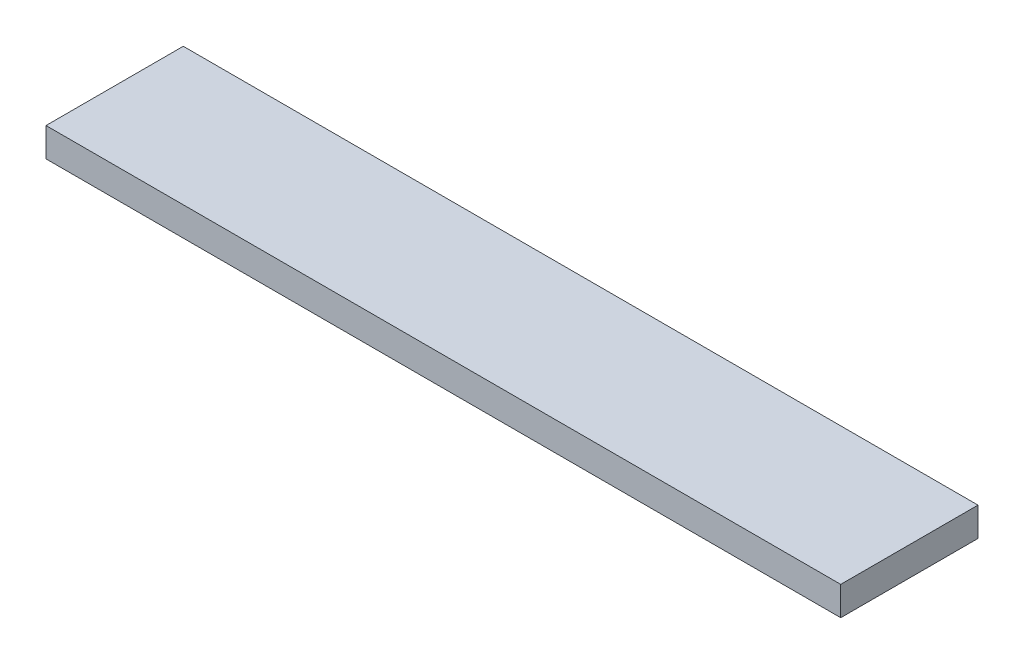
ISO-10303-21;
HEADER;
FILE_DESCRIPTION(('STEP AP214'),'2;1');
FILE_NAME('part.step','',(''),(''),'','','');
FILE_SCHEMA(('AUTOMOTIVE_DESIGN { 1 0 10303 214 1 1 1 1 }'));
ENDSEC;
DATA;
#1=APPLICATION_CONTEXT('core data for automotive mechanical design processes');
#2=APPLICATION_PROTOCOL_DEFINITION('international standard','automotive_design',2000,#1);
#3=PRODUCT_CONTEXT('',#1,'mechanical');
#4=PRODUCT('Part','Part','',(#3));
#5=PRODUCT_RELATED_PRODUCT_CATEGORY('part','',(#4));
#6=PRODUCT_DEFINITION_FORMATION('','',#4);
#7=PRODUCT_DEFINITION_CONTEXT('part definition',#1,'design');
#8=PRODUCT_DEFINITION('design','',#6,#7);
#9=PRODUCT_DEFINITION_SHAPE('','',#8);
#10=(LENGTH_UNIT() NAMED_UNIT(*) SI_UNIT(.MILLI.,.METRE.));
#11=(NAMED_UNIT(*) PLANE_ANGLE_UNIT() SI_UNIT($,.RADIAN.));
#12=(NAMED_UNIT(*) SI_UNIT($,.STERADIAN.) SOLID_ANGLE_UNIT());
#13=UNCERTAINTY_MEASURE_WITH_UNIT(LENGTH_MEASURE(1.E-05),#10,'distance_accuracy_value','');
#14=(GEOMETRIC_REPRESENTATION_CONTEXT(3) GLOBAL_UNCERTAINTY_ASSIGNED_CONTEXT((#13)) GLOBAL_UNIT_ASSIGNED_CONTEXT((#10,
#11,#12)) REPRESENTATION_CONTEXT('',''));
#15=CARTESIAN_POINT('',(0.,0.,0.));
#16=DIRECTION('',(0.,0.,1.));
#17=DIRECTION('',(1.,0.,0.));
#18=AXIS2_PLACEMENT_3D('',#15,#16,#17);
#19=CARTESIAN_POINT('',(0.,2.54,0.));
#20=DIRECTION('',(1.,0.,0.));
#21=DIRECTION('',(0.,0.,-1.));
#22=AXIS2_PLACEMENT_3D('',#19,#20,#21);
#23=PLANE('',#22);
#24=DIRECTION('',(0.,0.,1.));
#25=VECTOR('',#24,1.);
#26=CARTESIAN_POINT('',(0.,0.,0.));
#27=LINE('',#26,#25);
#28=CARTESIAN_POINT('',(0.,0.,-12.065));
#29=VERTEX_POINT('',#28);
#30=CARTESIAN_POINT('',(0.,0.,0.));
#31=VERTEX_POINT('',#30);
#32=EDGE_CURVE('E107',#29,#31,#27,.T.);
#33=ORIENTED_EDGE('',*,*,#32,.T.);
#34=DIRECTION('',(0.,-1.,0.));
#35=VECTOR('',#34,1.);
#36=CARTESIAN_POINT('',(0.,2.54,0.));
#37=LINE('',#36,#35);
#38=CARTESIAN_POINT('',(0.,2.54,0.));
#39=VERTEX_POINT('',#38);
#40=EDGE_CURVE('E11',#39,#31,#37,.T.);
#41=ORIENTED_EDGE('',*,*,#40,.F.);
#42=DIRECTION('',(0.,0.,1.));
#43=VECTOR('',#42,1.);
#44=CARTESIAN_POINT('',(0.,2.54,0.));
#45=LINE('',#44,#43);
#46=CARTESIAN_POINT('',(0.,2.54,-12.065));
#47=VERTEX_POINT('',#46);
#48=EDGE_CURVE('E91',#47,#39,#45,.T.);
#49=ORIENTED_EDGE('',*,*,#48,.F.);
#50=DIRECTION('',(0.,-1.,0.));
#51=VECTOR('',#50,1.);
#52=CARTESIAN_POINT('',(0.,2.54,-12.065));
#53=LINE('',#52,#51);
#54=EDGE_CURVE('E103',#47,#29,#53,.T.);
#55=ORIENTED_EDGE('',*,*,#54,.T.);
#56=EDGE_LOOP('',(#33,#41,#49,#55));
#57=FACE_BOUND('',#56,.T.);
#58=ADVANCED_FACE('F39',(#57),#23,.F.);
#59=CARTESIAN_POINT('',(0.,2.54,0.));
#60=DIRECTION('',(0.,0.,-1.));
#61=DIRECTION('',(-1.,0.,0.));
#62=AXIS2_PLACEMENT_3D('',#59,#60,#61);
#63=PLANE('',#62);
#64=DIRECTION('',(1.,0.,0.));
#65=VECTOR('',#64,1.);
#66=CARTESIAN_POINT('',(0.,0.,0.));
#67=LINE('',#66,#65);
#68=CARTESIAN_POINT('',(69.85,0.,0.));
#69=VERTEX_POINT('',#68);
#70=EDGE_CURVE('E96',#31,#69,#67,.T.);
#71=ORIENTED_EDGE('',*,*,#70,.T.);
#72=DIRECTION('',(0.,-1.,0.));
#73=VECTOR('',#72,1.);
#74=CARTESIAN_POINT('',(69.85,2.54,0.));
#75=LINE('',#74,#73);
#76=CARTESIAN_POINT('',(69.85,2.54,0.));
#77=VERTEX_POINT('',#76);
#78=EDGE_CURVE('E48',#77,#69,#75,.T.);
#79=ORIENTED_EDGE('',*,*,#78,.F.);
#80=DIRECTION('',(1.,0.,0.));
#81=VECTOR('',#80,1.);
#82=CARTESIAN_POINT('',(0.,2.54,0.));
#83=LINE('',#82,#81);
#84=EDGE_CURVE('E86',#39,#77,#83,.T.);
#85=ORIENTED_EDGE('',*,*,#84,.F.);
#86=ORIENTED_EDGE('',*,*,#40,.T.);
#87=EDGE_LOOP('',(#71,#79,#85,#86));
#88=FACE_BOUND('',#87,.T.);
#89=ADVANCED_FACE('F95',(#88),#63,.F.);
#90=CARTESIAN_POINT('',(69.85,2.54,0.));
#91=DIRECTION('',(-1.,0.,0.));
#92=DIRECTION('',(0.,0.,1.));
#93=AXIS2_PLACEMENT_3D('',#90,#91,#92);
#94=PLANE('',#93);
#95=DIRECTION('',(0.,0.,-1.));
#96=VECTOR('',#95,1.);
#97=CARTESIAN_POINT('',(69.85,0.,0.));
#98=LINE('',#97,#96);
#99=CARTESIAN_POINT('',(69.85,0.,-12.065));
#100=VERTEX_POINT('',#99);
#101=EDGE_CURVE('E73',#69,#100,#98,.T.);
#102=ORIENTED_EDGE('',*,*,#101,.T.);
#103=DIRECTION('',(0.,-1.,0.));
#104=VECTOR('',#103,1.);
#105=CARTESIAN_POINT('',(69.85,2.54,-12.065));
#106=LINE('',#105,#104);
#107=CARTESIAN_POINT('',(69.85,2.54,-12.065));
#108=VERTEX_POINT('',#107);
#109=EDGE_CURVE('E98',#108,#100,#106,.T.);
#110=ORIENTED_EDGE('',*,*,#109,.F.);
#111=DIRECTION('',(0.,0.,-1.));
#112=VECTOR('',#111,1.);
#113=CARTESIAN_POINT('',(69.85,2.54,0.));
#114=LINE('',#113,#112);
#115=EDGE_CURVE('E89',#77,#108,#114,.T.);
#116=ORIENTED_EDGE('',*,*,#115,.F.);
#117=ORIENTED_EDGE('',*,*,#78,.T.);
#118=EDGE_LOOP('',(#102,#110,#116,#117));
#119=FACE_BOUND('',#118,.T.);
#120=ADVANCED_FACE('F99',(#119),#94,.F.);
#121=CARTESIAN_POINT('',(0.,2.54,-12.065));
#122=DIRECTION('',(0.,0.,1.));
#123=DIRECTION('',(1.,0.,0.));
#124=AXIS2_PLACEMENT_3D('',#121,#122,#123);
#125=PLANE('',#124);
#126=DIRECTION('',(-1.,0.,0.));
#127=VECTOR('',#126,1.);
#128=CARTESIAN_POINT('',(0.,0.,-12.065));
#129=LINE('',#128,#127);
#130=EDGE_CURVE('E79',#100,#29,#129,.T.);
#131=ORIENTED_EDGE('',*,*,#130,.T.);
#132=ORIENTED_EDGE('',*,*,#54,.F.);
#133=DIRECTION('',(-1.,0.,0.));
#134=VECTOR('',#133,1.);
#135=CARTESIAN_POINT('',(0.,2.54,-12.065));
#136=LINE('',#135,#134);
#137=EDGE_CURVE('E56',#108,#47,#136,.T.);
#138=ORIENTED_EDGE('',*,*,#137,.F.);
#139=ORIENTED_EDGE('',*,*,#109,.T.);
#140=EDGE_LOOP('',(#131,#132,#138,#139));
#141=FACE_BOUND('',#140,.T.);
#142=ADVANCED_FACE('F120',(#141),#125,.F.);
#143=CARTESIAN_POINT('',(0.,2.54,0.));
#144=DIRECTION('',(0.,-1.,0.));
#145=DIRECTION('',(0.,0.,-1.));
#146=AXIS2_PLACEMENT_3D('',#143,#144,#145);
#147=PLANE('',#146);
#148=ORIENTED_EDGE('',*,*,#48,.T.);
#149=ORIENTED_EDGE('',*,*,#84,.T.);
#150=ORIENTED_EDGE('',*,*,#115,.T.);
#151=ORIENTED_EDGE('',*,*,#137,.T.);
#152=EDGE_LOOP('',(#148,#149,#150,#151));
#153=FACE_BOUND('',#152,.T.);
#154=ADVANCED_FACE('F87',(#153),#147,.F.);
#155=CARTESIAN_POINT('',(0.,0.,0.));
#156=DIRECTION('',(0.,-1.,0.));
#157=DIRECTION('',(0.,0.,-1.));
#158=AXIS2_PLACEMENT_3D('',#155,#156,#157);
#159=PLANE('',#158);
#160=ORIENTED_EDGE('',*,*,#32,.F.);
#161=ORIENTED_EDGE('',*,*,#130,.F.);
#162=ORIENTED_EDGE('',*,*,#101,.F.);
#163=ORIENTED_EDGE('',*,*,#70,.F.);
#164=EDGE_LOOP('',(#160,#161,#162,#163));
#165=FACE_BOUND('',#164,.T.);
#166=ADVANCED_FACE('F123',(#165),#159,.T.);
#167=CLOSED_SHELL('',(#58,#89,#120,#142,#154,#166));
#168=MANIFOLD_SOLID_BREP('B2',#167);
#169=ADVANCED_BREP_SHAPE_REPRESENTATION('',(#18,#168),#14);
#170=SHAPE_DEFINITION_REPRESENTATION(#9,#169);
ENDSEC;
END-ISO-10303-21;
